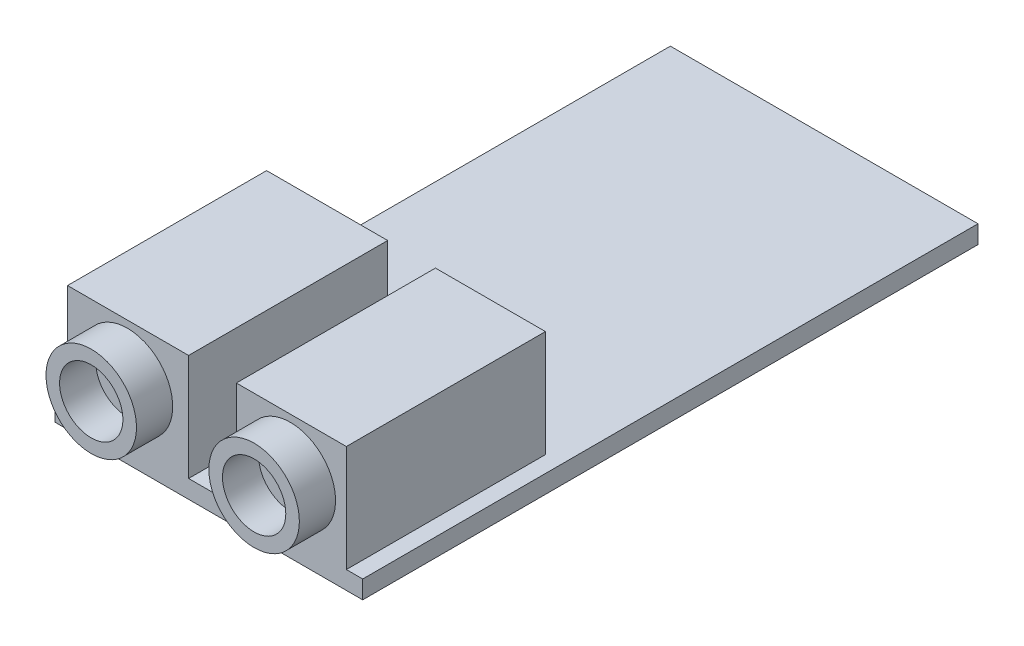
ISO-10303-21;
HEADER;
FILE_DESCRIPTION(('STEP AP214'),'2;1');
FILE_NAME('part.step','',(''),(''),'','','');
FILE_SCHEMA(('AUTOMOTIVE_DESIGN { 1 0 10303 214 1 1 1 1 }'));
ENDSEC;
DATA;
#1=APPLICATION_CONTEXT('core data for automotive mechanical design processes');
#2=APPLICATION_PROTOCOL_DEFINITION('international standard','automotive_design',2000,#1);
#3=PRODUCT_CONTEXT('',#1,'mechanical');
#4=PRODUCT('Part','Part','',(#3));
#5=PRODUCT_RELATED_PRODUCT_CATEGORY('part','',(#4));
#6=PRODUCT_DEFINITION_FORMATION('','',#4);
#7=PRODUCT_DEFINITION_CONTEXT('part definition',#1,'design');
#8=PRODUCT_DEFINITION('design','',#6,#7);
#9=PRODUCT_DEFINITION_SHAPE('','',#8);
#10=(LENGTH_UNIT() NAMED_UNIT(*) SI_UNIT(.MILLI.,.METRE.));
#11=(NAMED_UNIT(*) PLANE_ANGLE_UNIT() SI_UNIT($,.RADIAN.));
#12=(NAMED_UNIT(*) SI_UNIT($,.STERADIAN.) SOLID_ANGLE_UNIT());
#13=UNCERTAINTY_MEASURE_WITH_UNIT(LENGTH_MEASURE(1.E-05),#10,'distance_accuracy_value','');
#14=(GEOMETRIC_REPRESENTATION_CONTEXT(3) GLOBAL_UNCERTAINTY_ASSIGNED_CONTEXT((#13)) GLOBAL_UNIT_ASSIGNED_CONTEXT((#10,
#11,#12)) REPRESENTATION_CONTEXT('',''));
#15=CARTESIAN_POINT('',(0.,0.,0.));
#16=DIRECTION('',(0.,0.,1.));
#17=DIRECTION('',(1.,0.,0.));
#18=AXIS2_PLACEMENT_3D('',#15,#16,#17);
#19=CARTESIAN_POINT('',(0.,1.,0.));
#20=DIRECTION('',(0.,-1.,0.));
#21=DIRECTION('',(0.,0.,-1.));
#22=AXIS2_PLACEMENT_3D('',#19,#20,#21);
#23=PLANE('',#22);
#24=DIRECTION('',(1.,0.,0.));
#25=VECTOR('',#24,1.);
#26=CARTESIAN_POINT('',(-8.5,1.,17.));
#27=LINE('',#26,#25);
#28=CARTESIAN_POINT('',(-1.11955702747559,1.,17.));
#29=VERTEX_POINT('',#28);
#30=CARTESIAN_POINT('',(1.51939882300259,1.,17.));
#31=VERTEX_POINT('',#30);
#32=EDGE_CURVE('E213',#29,#31,#27,.T.);
#33=ORIENTED_EDGE('',*,*,#32,.T.);
#34=DIRECTION('',(0.,0.,1.));
#35=VECTOR('',#34,1.);
#36=CARTESIAN_POINT('',(1.51939882300259,1.,6.00000000000001));
#37=LINE('',#36,#35);
#38=CARTESIAN_POINT('',(1.51939882300259,1.,6.00000000000001));
#39=VERTEX_POINT('',#38);
#40=EDGE_CURVE('E57',#39,#31,#37,.T.);
#41=ORIENTED_EDGE('',*,*,#40,.F.);
#42=DIRECTION('',(1.,0.,0.));
#43=VECTOR('',#42,1.);
#44=CARTESIAN_POINT('',(1.51939882300259,1.,6.00000000000001));
#45=LINE('',#44,#43);
#46=CARTESIAN_POINT('',(7.59699411501296,1.,6.00000000000001));
#47=VERTEX_POINT('',#46);
#48=EDGE_CURVE('E52',#39,#47,#45,.T.);
#49=ORIENTED_EDGE('',*,*,#48,.T.);
#50=DIRECTION('',(0.,0.,1.));
#51=VECTOR('',#50,1.);
#52=CARTESIAN_POINT('',(7.59699411501296,1.,6.00000000000001));
#53=LINE('',#52,#51);
#54=CARTESIAN_POINT('',(7.59699411501296,1.,17.));
#55=VERTEX_POINT('',#54);
#56=EDGE_CURVE('E136',#47,#55,#53,.T.);
#57=ORIENTED_EDGE('',*,*,#56,.T.);
#58=CARTESIAN_POINT('',(8.5,1.,17.));
#59=VERTEX_POINT('',#58);
#60=EDGE_CURVE('E212',#55,#59,#27,.T.);
#61=ORIENTED_EDGE('',*,*,#60,.T.);
#62=DIRECTION('',(0.,0.,-1.));
#63=VECTOR('',#62,1.);
#64=CARTESIAN_POINT('',(8.5,1.,17.));
#65=LINE('',#64,#63);
#66=CARTESIAN_POINT('',(8.5,1.,-17.));
#67=VERTEX_POINT('',#66);
#68=EDGE_CURVE('E216',#59,#67,#65,.T.);
#69=ORIENTED_EDGE('',*,*,#68,.T.);
#70=DIRECTION('',(-1.,0.,0.));
#71=VECTOR('',#70,1.);
#72=CARTESIAN_POINT('',(-8.5,1.,-17.));
#73=LINE('',#72,#71);
#74=CARTESIAN_POINT('',(-8.5,1.,-17.));
#75=VERTEX_POINT('',#74);
#76=EDGE_CURVE('E236',#67,#75,#73,.T.);
#77=ORIENTED_EDGE('',*,*,#76,.T.);
#78=DIRECTION('',(0.,0.,1.));
#79=VECTOR('',#78,1.);
#80=CARTESIAN_POINT('',(-8.5,1.,17.));
#81=LINE('',#80,#79);
#82=CARTESIAN_POINT('',(-8.5,1.,17.));
#83=VERTEX_POINT('',#82);
#84=EDGE_CURVE('E195',#75,#83,#81,.T.);
#85=ORIENTED_EDGE('',*,*,#84,.T.);
#86=CARTESIAN_POINT('',(-7.81024307262736,1.,17.));
#87=VERTEX_POINT('',#86);
#88=EDGE_CURVE('E222',#83,#87,#27,.T.);
#89=ORIENTED_EDGE('',*,*,#88,.T.);
#90=DIRECTION('',(0.,0.,1.));
#91=VECTOR('',#90,1.);
#92=CARTESIAN_POINT('',(-7.81024307262736,1.,6.00000000000001));
#93=LINE('',#92,#91);
#94=CARTESIAN_POINT('',(-7.81024307262736,1.,6.00000000000001));
#95=VERTEX_POINT('',#94);
#96=EDGE_CURVE('E183',#95,#87,#93,.T.);
#97=ORIENTED_EDGE('',*,*,#96,.F.);
#98=DIRECTION('',(1.,0.,0.));
#99=VECTOR('',#98,1.);
#100=CARTESIAN_POINT('',(-7.81024307262736,1.,6.00000000000001));
#101=LINE('',#100,#99);
#102=CARTESIAN_POINT('',(-1.11955702747559,1.,6.00000000000001));
#103=VERTEX_POINT('',#102);
#104=EDGE_CURVE('E173',#95,#103,#101,.T.);
#105=ORIENTED_EDGE('',*,*,#104,.T.);
#106=DIRECTION('',(0.,0.,1.));
#107=VECTOR('',#106,1.);
#108=CARTESIAN_POINT('',(-1.11955702747559,1.,6.00000000000001));
#109=LINE('',#108,#107);
#110=EDGE_CURVE('E192',#103,#29,#109,.T.);
#111=ORIENTED_EDGE('',*,*,#110,.T.);
#112=EDGE_LOOP('',(#33,#41,#49,#57,#61,#69,#77,#85,#89,#97,#105,#111));
#113=FACE_BOUND('',#112,.T.);
#114=ADVANCED_FACE('F37',(#113),#23,.F.);
#115=CARTESIAN_POINT('',(-8.5,1.,17.));
#116=DIRECTION('',(1.,0.,0.));
#117=DIRECTION('',(0.,0.,-1.));
#118=AXIS2_PLACEMENT_3D('',#115,#116,#117);
#119=PLANE('',#118);
#120=DIRECTION('',(0.,0.,1.));
#121=VECTOR('',#120,1.);
#122=CARTESIAN_POINT('',(-8.5,0.,17.));
#123=LINE('',#122,#121);
#124=CARTESIAN_POINT('',(-8.5,0.,-17.));
#125=VERTEX_POINT('',#124);
#126=CARTESIAN_POINT('',(-8.5,0.,17.));
#127=VERTEX_POINT('',#126);
#128=EDGE_CURVE('E189',#125,#127,#123,.T.);
#129=ORIENTED_EDGE('',*,*,#128,.T.);
#130=DIRECTION('',(0.,-1.,0.));
#131=VECTOR('',#130,1.);
#132=CARTESIAN_POINT('',(-8.5,1.,17.));
#133=LINE('',#132,#131);
#134=EDGE_CURVE('E211',#83,#127,#133,.T.);
#135=ORIENTED_EDGE('',*,*,#134,.F.);
#136=ORIENTED_EDGE('',*,*,#84,.F.);
#137=DIRECTION('',(0.,-1.,0.));
#138=VECTOR('',#137,1.);
#139=CARTESIAN_POINT('',(-8.5,1.,-17.));
#140=LINE('',#139,#138);
#141=EDGE_CURVE('E233',#75,#125,#140,.T.);
#142=ORIENTED_EDGE('',*,*,#141,.T.);
#143=EDGE_LOOP('',(#129,#135,#136,#142));
#144=FACE_BOUND('',#143,.T.);
#145=ADVANCED_FACE('F39',(#144),#119,.F.);
#146=CARTESIAN_POINT('',(-8.5,1.,17.));
#147=DIRECTION('',(0.,0.,-1.));
#148=DIRECTION('',(-1.,0.,0.));
#149=AXIS2_PLACEMENT_3D('',#146,#147,#148);
#150=PLANE('',#149);
#151=CARTESIAN_POINT('',(4.5,4.,17.));
#152=DIRECTION('',(0.,0.,-1.));
#153=DIRECTION('',(-1.,0.,0.));
#154=AXIS2_PLACEMENT_3D('',#151,#152,#153);
#155=CIRCLE('',#154,2.5);
#156=CARTESIAN_POINT('',(2.,4.,17.));
#157=VERTEX_POINT('',#156);
#158=EDGE_CURVE('E11',#157,#157,#155,.F.);
#159=ORIENTED_EDGE('',*,*,#158,.F.);
#160=EDGE_LOOP('',(#159));
#161=FACE_BOUND('',#160,.T.);
#162=CARTESIAN_POINT('',(-4.5,4.,17.));
#163=DIRECTION('',(0.,0.,-1.));
#164=DIRECTION('',(-1.,0.,0.));
#165=AXIS2_PLACEMENT_3D('',#162,#163,#164);
#166=CIRCLE('',#165,2.5);
#167=CARTESIAN_POINT('',(-7.,4.,17.));
#168=VERTEX_POINT('',#167);
#169=EDGE_CURVE('E45',#168,#168,#166,.F.);
#170=ORIENTED_EDGE('',*,*,#169,.F.);
#171=EDGE_LOOP('',(#170));
#172=FACE_BOUND('',#171,.T.);
#173=DIRECTION('',(1.,0.,0.));
#174=VECTOR('',#173,1.);
#175=CARTESIAN_POINT('',(-8.5,0.,17.));
#176=LINE('',#175,#174);
#177=CARTESIAN_POINT('',(8.5,0.,17.));
#178=VERTEX_POINT('',#177);
#179=EDGE_CURVE('E241',#127,#178,#176,.T.);
#180=ORIENTED_EDGE('',*,*,#179,.T.);
#181=DIRECTION('',(0.,-1.,0.));
#182=VECTOR('',#181,1.);
#183=CARTESIAN_POINT('',(8.5,1.,17.));
#184=LINE('',#183,#182);
#185=EDGE_CURVE('E227',#59,#178,#184,.T.);
#186=ORIENTED_EDGE('',*,*,#185,.F.);
#187=ORIENTED_EDGE('',*,*,#60,.F.);
#188=DIRECTION('',(0.,1.,0.));
#189=VECTOR('',#188,1.);
#190=CARTESIAN_POINT('',(7.59699411501296,1.,17.));
#191=LINE('',#190,#189);
#192=CARTESIAN_POINT('',(7.59699411501296,6.88856033929579,17.));
#193=VERTEX_POINT('',#192);
#194=EDGE_CURVE('E154',#55,#193,#191,.T.);
#195=ORIENTED_EDGE('',*,*,#194,.T.);
#196=DIRECTION('',(-1.,0.,0.));
#197=VECTOR('',#196,1.);
#198=CARTESIAN_POINT('',(1.51939882300259,6.88856033929579,17.));
#199=LINE('',#198,#197);
#200=CARTESIAN_POINT('',(1.51939882300259,6.88856033929579,17.));
#201=VERTEX_POINT('',#200);
#202=EDGE_CURVE('E131',#193,#201,#199,.T.);
#203=ORIENTED_EDGE('',*,*,#202,.T.);
#204=DIRECTION('',(0.,-1.,0.));
#205=VECTOR('',#204,1.);
#206=CARTESIAN_POINT('',(1.51939882300259,1.,17.));
#207=LINE('',#206,#205);
#208=EDGE_CURVE('E151',#201,#31,#207,.T.);
#209=ORIENTED_EDGE('',*,*,#208,.T.);
#210=ORIENTED_EDGE('',*,*,#32,.F.);
#211=DIRECTION('',(0.,1.,0.));
#212=VECTOR('',#211,1.);
#213=CARTESIAN_POINT('',(-1.11955702747559,1.,17.));
#214=LINE('',#213,#212);
#215=CARTESIAN_POINT('',(-1.11955702747559,6.88856033929579,17.));
#216=VERTEX_POINT('',#215);
#217=EDGE_CURVE('E186',#29,#216,#214,.T.);
#218=ORIENTED_EDGE('',*,*,#217,.T.);
#219=DIRECTION('',(-1.,0.,0.));
#220=VECTOR('',#219,1.);
#221=CARTESIAN_POINT('',(-7.81024307262736,6.88856033929579,17.));
#222=LINE('',#221,#220);
#223=CARTESIAN_POINT('',(-7.81024307262736,6.88856033929579,17.));
#224=VERTEX_POINT('',#223);
#225=EDGE_CURVE('E174',#216,#224,#222,.T.);
#226=ORIENTED_EDGE('',*,*,#225,.T.);
#227=DIRECTION('',(0.,-1.,0.));
#228=VECTOR('',#227,1.);
#229=CARTESIAN_POINT('',(-7.81024307262736,1.,17.));
#230=LINE('',#229,#228);
#231=EDGE_CURVE('E169',#224,#87,#230,.T.);
#232=ORIENTED_EDGE('',*,*,#231,.T.);
#233=ORIENTED_EDGE('',*,*,#88,.F.);
#234=ORIENTED_EDGE('',*,*,#134,.T.);
#235=EDGE_LOOP('',(#180,#186,#187,#195,#203,#209,#210,#218,#226,#232,#233,#234));
#236=FACE_BOUND('',#235,.T.);
#237=ADVANCED_FACE('F262',(#161,#172,#236),#150,.F.);
#238=CARTESIAN_POINT('',(8.5,1.,17.));
#239=DIRECTION('',(-1.,0.,0.));
#240=DIRECTION('',(0.,0.,1.));
#241=AXIS2_PLACEMENT_3D('',#238,#239,#240);
#242=PLANE('',#241);
#243=DIRECTION('',(0.,0.,-1.));
#244=VECTOR('',#243,1.);
#245=CARTESIAN_POINT('',(8.5,0.,17.));
#246=LINE('',#245,#244);
#247=CARTESIAN_POINT('',(8.5,0.,-17.));
#248=VERTEX_POINT('',#247);
#249=EDGE_CURVE('E239',#178,#248,#246,.T.);
#250=ORIENTED_EDGE('',*,*,#249,.T.);
#251=DIRECTION('',(0.,-1.,0.));
#252=VECTOR('',#251,1.);
#253=CARTESIAN_POINT('',(8.5,1.,-17.));
#254=LINE('',#253,#252);
#255=EDGE_CURVE('E230',#67,#248,#254,.T.);
#256=ORIENTED_EDGE('',*,*,#255,.F.);
#257=ORIENTED_EDGE('',*,*,#68,.F.);
#258=ORIENTED_EDGE('',*,*,#185,.T.);
#259=EDGE_LOOP('',(#250,#256,#257,#258));
#260=FACE_BOUND('',#259,.T.);
#261=ADVANCED_FACE('F251',(#260),#242,.F.);
#262=CARTESIAN_POINT('',(-8.5,1.,-17.));
#263=DIRECTION('',(0.,0.,1.));
#264=DIRECTION('',(1.,0.,0.));
#265=AXIS2_PLACEMENT_3D('',#262,#263,#264);
#266=PLANE('',#265);
#267=DIRECTION('',(-1.,0.,0.));
#268=VECTOR('',#267,1.);
#269=CARTESIAN_POINT('',(-8.5,0.,-17.));
#270=LINE('',#269,#268);
#271=EDGE_CURVE('E237',#248,#125,#270,.T.);
#272=ORIENTED_EDGE('',*,*,#271,.T.);
#273=ORIENTED_EDGE('',*,*,#141,.F.);
#274=ORIENTED_EDGE('',*,*,#76,.F.);
#275=ORIENTED_EDGE('',*,*,#255,.T.);
#276=EDGE_LOOP('',(#272,#273,#274,#275));
#277=FACE_BOUND('',#276,.T.);
#278=ADVANCED_FACE('F255',(#277),#266,.F.);
#279=CARTESIAN_POINT('',(0.,0.,0.));
#280=DIRECTION('',(0.,-1.,0.));
#281=DIRECTION('',(0.,0.,-1.));
#282=AXIS2_PLACEMENT_3D('',#279,#280,#281);
#283=PLANE('',#282);
#284=ORIENTED_EDGE('',*,*,#128,.F.);
#285=ORIENTED_EDGE('',*,*,#271,.F.);
#286=ORIENTED_EDGE('',*,*,#249,.F.);
#287=ORIENTED_EDGE('',*,*,#179,.F.);
#288=EDGE_LOOP('',(#284,#285,#286,#287));
#289=FACE_BOUND('',#288,.T.);
#290=ADVANCED_FACE('F316',(#289),#283,.T.);
#291=CARTESIAN_POINT('',(-7.81024307262736,1.,6.00000000000001));
#292=DIRECTION('',(-1.,0.,0.));
#293=DIRECTION('',(0.,0.,1.));
#294=AXIS2_PLACEMENT_3D('',#291,#292,#293);
#295=PLANE('',#294);
#296=ORIENTED_EDGE('',*,*,#231,.F.);
#297=DIRECTION('',(0.,0.,1.));
#298=VECTOR('',#297,1.);
#299=CARTESIAN_POINT('',(-7.81024307262736,6.88856033929579,6.00000000000001));
#300=LINE('',#299,#298);
#301=CARTESIAN_POINT('',(-7.81024307262736,6.88856033929579,6.00000000000001));
#302=VERTEX_POINT('',#301);
#303=EDGE_CURVE('E187',#302,#224,#300,.T.);
#304=ORIENTED_EDGE('',*,*,#303,.F.);
#305=DIRECTION('',(0.,-1.,0.));
#306=VECTOR('',#305,1.);
#307=CARTESIAN_POINT('',(-7.81024307262736,1.,6.00000000000001));
#308=LINE('',#307,#306);
#309=EDGE_CURVE('E170',#302,#95,#308,.T.);
#310=ORIENTED_EDGE('',*,*,#309,.T.);
#311=ORIENTED_EDGE('',*,*,#96,.T.);
#312=EDGE_LOOP('',(#296,#304,#310,#311));
#313=FACE_BOUND('',#312,.T.);
#314=ADVANCED_FACE('F267',(#313),#295,.T.);
#315=CARTESIAN_POINT('',(-7.81024307262736,6.88856033929579,6.00000000000001));
#316=DIRECTION('',(0.,1.,0.));
#317=DIRECTION('',(0.,0.,1.));
#318=AXIS2_PLACEMENT_3D('',#315,#316,#317);
#319=PLANE('',#318);
#320=ORIENTED_EDGE('',*,*,#225,.F.);
#321=DIRECTION('',(0.,0.,1.));
#322=VECTOR('',#321,1.);
#323=CARTESIAN_POINT('',(-1.11955702747559,6.88856033929579,6.00000000000001));
#324=LINE('',#323,#322);
#325=CARTESIAN_POINT('',(-1.11955702747559,6.88856033929579,6.00000000000001));
#326=VERTEX_POINT('',#325);
#327=EDGE_CURVE('E190',#326,#216,#324,.T.);
#328=ORIENTED_EDGE('',*,*,#327,.F.);
#329=DIRECTION('',(-1.,0.,0.));
#330=VECTOR('',#329,1.);
#331=CARTESIAN_POINT('',(-7.81024307262736,6.88856033929579,6.00000000000001));
#332=LINE('',#331,#330);
#333=EDGE_CURVE('E180',#326,#302,#332,.T.);
#334=ORIENTED_EDGE('',*,*,#333,.T.);
#335=ORIENTED_EDGE('',*,*,#303,.T.);
#336=EDGE_LOOP('',(#320,#328,#334,#335));
#337=FACE_BOUND('',#336,.T.);
#338=ADVANCED_FACE('F274',(#337),#319,.T.);
#339=CARTESIAN_POINT('',(-1.11955702747559,1.,6.00000000000001));
#340=DIRECTION('',(1.,0.,0.));
#341=DIRECTION('',(0.,0.,-1.));
#342=AXIS2_PLACEMENT_3D('',#339,#340,#341);
#343=PLANE('',#342);
#344=ORIENTED_EDGE('',*,*,#217,.F.);
#345=ORIENTED_EDGE('',*,*,#110,.F.);
#346=DIRECTION('',(0.,1.,0.));
#347=VECTOR('',#346,1.);
#348=CARTESIAN_POINT('',(-1.11955702747559,1.,6.00000000000001));
#349=LINE('',#348,#347);
#350=EDGE_CURVE('E177',#103,#326,#349,.T.);
#351=ORIENTED_EDGE('',*,*,#350,.T.);
#352=ORIENTED_EDGE('',*,*,#327,.T.);
#353=EDGE_LOOP('',(#344,#345,#351,#352));
#354=FACE_BOUND('',#353,.T.);
#355=ADVANCED_FACE('F276',(#354),#343,.T.);
#356=CARTESIAN_POINT('',(0.,0.,6.00000000000001));
#357=DIRECTION('',(0.,0.,-1.));
#358=DIRECTION('',(-1.,0.,0.));
#359=AXIS2_PLACEMENT_3D('',#356,#357,#358);
#360=PLANE('',#359);
#361=ORIENTED_EDGE('',*,*,#309,.F.);
#362=ORIENTED_EDGE('',*,*,#333,.F.);
#363=ORIENTED_EDGE('',*,*,#350,.F.);
#364=ORIENTED_EDGE('',*,*,#104,.F.);
#365=EDGE_LOOP('',(#361,#362,#363,#364));
#366=FACE_BOUND('',#365,.T.);
#367=ADVANCED_FACE('F271',(#366),#360,.T.);
#368=CARTESIAN_POINT('',(-4.5,4.,19.));
#369=DIRECTION('',(0.,0.,1.));
#370=DIRECTION('',(1.,0.,0.));
#371=AXIS2_PLACEMENT_3D('',#368,#369,#370);
#372=PLANE('',#371);
#373=CARTESIAN_POINT('',(-4.5,4.,19.));
#374=DIRECTION('',(0.,0.,1.));
#375=DIRECTION('',(1.,0.,0.));
#376=AXIS2_PLACEMENT_3D('',#373,#374,#375);
#377=CIRCLE('',#376,2.5);
#378=CARTESIAN_POINT('',(-2.,4.,19.));
#379=VERTEX_POINT('',#378);
#380=EDGE_CURVE('E164',#379,#379,#377,.T.);
#381=ORIENTED_EDGE('',*,*,#380,.T.);
#382=EDGE_LOOP('',(#381));
#383=FACE_BOUND('',#382,.T.);
#384=CARTESIAN_POINT('',(-4.5,4.,19.));
#385=DIRECTION('',(0.,0.,1.));
#386=DIRECTION('',(1.,0.,0.));
#387=AXIS2_PLACEMENT_3D('',#384,#385,#386);
#388=CIRCLE('',#387,1.75);
#389=CARTESIAN_POINT('',(-2.75,4.,19.));
#390=VERTEX_POINT('',#389);
#391=EDGE_CURVE('E161',#390,#390,#388,.T.);
#392=ORIENTED_EDGE('',*,*,#391,.F.);
#393=EDGE_LOOP('',(#392));
#394=FACE_BOUND('',#393,.T.);
#395=ADVANCED_FACE('F349',(#383,#394),#372,.T.);
#396=CARTESIAN_POINT('',(-4.5,4.,19.));
#397=DIRECTION('',(0.,0.,-1.));
#398=DIRECTION('',(-1.,0.,0.));
#399=AXIS2_PLACEMENT_3D('',#396,#397,#398);
#400=CYLINDRICAL_SURFACE('',#399,2.5);
#401=ORIENTED_EDGE('',*,*,#380,.F.);
#402=EDGE_LOOP('',(#401));
#403=FACE_BOUND('',#402,.T.);
#404=ORIENTED_EDGE('',*,*,#169,.T.);
#405=EDGE_LOOP('',(#404));
#406=FACE_BOUND('',#405,.T.);
#407=ADVANCED_FACE('F341',(#403,#406),#400,.T.);
#408=CARTESIAN_POINT('',(-4.5,4.,19.));
#409=DIRECTION('',(0.,0.,-1.));
#410=DIRECTION('',(-1.,0.,0.));
#411=AXIS2_PLACEMENT_3D('',#408,#409,#410);
#412=CYLINDRICAL_SURFACE('',#411,1.75);
#413=ORIENTED_EDGE('',*,*,#391,.T.);
#414=EDGE_LOOP('',(#413));
#415=FACE_BOUND('',#414,.T.);
#416=CARTESIAN_POINT('',(-4.5,4.,17.));
#417=DIRECTION('',(0.,0.,1.));
#418=DIRECTION('',(1.,0.,0.));
#419=AXIS2_PLACEMENT_3D('',#416,#417,#418);
#420=CIRCLE('',#419,1.75);
#421=CARTESIAN_POINT('',(-2.75,4.,17.));
#422=VERTEX_POINT('',#421);
#423=EDGE_CURVE('E158',#422,#422,#420,.T.);
#424=ORIENTED_EDGE('',*,*,#423,.F.);
#425=EDGE_LOOP('',(#424));
#426=FACE_BOUND('',#425,.T.);
#427=ADVANCED_FACE('F334',(#415,#426),#412,.F.);
#428=ORIENTED_EDGE('',*,*,#423,.T.);
#429=EDGE_LOOP('',(#428));
#430=FACE_BOUND('',#429,.T.);
#431=ADVANCED_FACE('F326',(#430),#150,.F.);
#432=CARTESIAN_POINT('',(1.51939882300259,1.,6.00000000000001));
#433=DIRECTION('',(-1.,0.,0.));
#434=DIRECTION('',(0.,0.,1.));
#435=AXIS2_PLACEMENT_3D('',#432,#433,#434);
#436=PLANE('',#435);
#437=ORIENTED_EDGE('',*,*,#208,.F.);
#438=DIRECTION('',(0.,0.,1.));
#439=VECTOR('',#438,1.);
#440=CARTESIAN_POINT('',(1.51939882300259,6.88856033929579,6.00000000000001));
#441=LINE('',#440,#439);
#442=CARTESIAN_POINT('',(1.51939882300259,6.88856033929579,6.00000000000001));
#443=VERTEX_POINT('',#442);
#444=EDGE_CURVE('E135',#443,#201,#441,.T.);
#445=ORIENTED_EDGE('',*,*,#444,.F.);
#446=DIRECTION('',(0.,-1.,0.));
#447=VECTOR('',#446,1.);
#448=CARTESIAN_POINT('',(1.51939882300259,1.,6.00000000000001));
#449=LINE('',#448,#447);
#450=EDGE_CURVE('E146',#443,#39,#449,.T.);
#451=ORIENTED_EDGE('',*,*,#450,.T.);
#452=ORIENTED_EDGE('',*,*,#40,.T.);
#453=EDGE_LOOP('',(#437,#445,#451,#452));
#454=FACE_BOUND('',#453,.T.);
#455=ADVANCED_FACE('F280',(#454),#436,.T.);
#456=CARTESIAN_POINT('',(1.51939882300259,6.88856033929579,6.00000000000001));
#457=DIRECTION('',(0.,1.,0.));
#458=DIRECTION('',(0.,0.,1.));
#459=AXIS2_PLACEMENT_3D('',#456,#457,#458);
#460=PLANE('',#459);
#461=ORIENTED_EDGE('',*,*,#202,.F.);
#462=DIRECTION('',(0.,0.,1.));
#463=VECTOR('',#462,1.);
#464=CARTESIAN_POINT('',(7.59699411501296,6.88856033929579,6.00000000000001));
#465=LINE('',#464,#463);
#466=CARTESIAN_POINT('',(7.59699411501296,6.88856033929579,6.00000000000001));
#467=VERTEX_POINT('',#466);
#468=EDGE_CURVE('E125',#467,#193,#465,.T.);
#469=ORIENTED_EDGE('',*,*,#468,.F.);
#470=DIRECTION('',(-1.,0.,0.));
#471=VECTOR('',#470,1.);
#472=CARTESIAN_POINT('',(1.51939882300259,6.88856033929579,6.00000000000001));
#473=LINE('',#472,#471);
#474=EDGE_CURVE('E129',#467,#443,#473,.T.);
#475=ORIENTED_EDGE('',*,*,#474,.T.);
#476=ORIENTED_EDGE('',*,*,#444,.T.);
#477=EDGE_LOOP('',(#461,#469,#475,#476));
#478=FACE_BOUND('',#477,.T.);
#479=ADVANCED_FACE('F127',(#478),#460,.T.);
#480=CARTESIAN_POINT('',(7.59699411501296,1.,6.00000000000001));
#481=DIRECTION('',(1.,0.,0.));
#482=DIRECTION('',(0.,0.,-1.));
#483=AXIS2_PLACEMENT_3D('',#480,#481,#482);
#484=PLANE('',#483);
#485=ORIENTED_EDGE('',*,*,#194,.F.);
#486=ORIENTED_EDGE('',*,*,#56,.F.);
#487=DIRECTION('',(0.,1.,0.));
#488=VECTOR('',#487,1.);
#489=CARTESIAN_POINT('',(7.59699411501296,1.,6.00000000000001));
#490=LINE('',#489,#488);
#491=EDGE_CURVE('E139',#47,#467,#490,.T.);
#492=ORIENTED_EDGE('',*,*,#491,.T.);
#493=ORIENTED_EDGE('',*,*,#468,.T.);
#494=EDGE_LOOP('',(#485,#486,#492,#493));
#495=FACE_BOUND('',#494,.T.);
#496=ADVANCED_FACE('F140',(#495),#484,.T.);
#497=CARTESIAN_POINT('',(0.,0.,6.00000000000001));
#498=DIRECTION('',(0.,0.,-1.));
#499=DIRECTION('',(-1.,0.,0.));
#500=AXIS2_PLACEMENT_3D('',#497,#498,#499);
#501=PLANE('',#500);
#502=ORIENTED_EDGE('',*,*,#450,.F.);
#503=ORIENTED_EDGE('',*,*,#474,.F.);
#504=ORIENTED_EDGE('',*,*,#491,.F.);
#505=ORIENTED_EDGE('',*,*,#48,.F.);
#506=EDGE_LOOP('',(#502,#503,#504,#505));
#507=FACE_BOUND('',#506,.T.);
#508=ADVANCED_FACE('F144',(#507),#501,.T.);
#509=CARTESIAN_POINT('',(4.5,4.,19.));
#510=DIRECTION('',(0.,0.,1.));
#511=DIRECTION('',(1.,0.,0.));
#512=AXIS2_PLACEMENT_3D('',#509,#510,#511);
#513=PLANE('',#512);
#514=CARTESIAN_POINT('',(4.5,4.,19.));
#515=DIRECTION('',(0.,0.,1.));
#516=DIRECTION('',(1.,0.,0.));
#517=AXIS2_PLACEMENT_3D('',#514,#515,#516);
#518=CIRCLE('',#517,2.5);
#519=CARTESIAN_POINT('',(7.,4.,19.));
#520=VERTEX_POINT('',#519);
#521=EDGE_CURVE('E155',#520,#520,#518,.T.);
#522=ORIENTED_EDGE('',*,*,#521,.T.);
#523=EDGE_LOOP('',(#522));
#524=FACE_BOUND('',#523,.T.);
#525=CARTESIAN_POINT('',(4.5,4.,19.));
#526=DIRECTION('',(0.,0.,1.));
#527=DIRECTION('',(1.,0.,0.));
#528=AXIS2_PLACEMENT_3D('',#525,#526,#527);
#529=CIRCLE('',#528,1.75);
#530=CARTESIAN_POINT('',(6.25,4.,19.));
#531=VERTEX_POINT('',#530);
#532=EDGE_CURVE('E285',#531,#531,#529,.T.);
#533=ORIENTED_EDGE('',*,*,#532,.F.);
#534=EDGE_LOOP('',(#533));
#535=FACE_BOUND('',#534,.T.);
#536=ADVANCED_FACE('F295',(#524,#535),#513,.T.);
#537=CARTESIAN_POINT('',(4.5,4.,19.));
#538=DIRECTION('',(0.,0.,-1.));
#539=DIRECTION('',(-1.,0.,0.));
#540=AXIS2_PLACEMENT_3D('',#537,#538,#539);
#541=CYLINDRICAL_SURFACE('',#540,2.5);
#542=ORIENTED_EDGE('',*,*,#521,.F.);
#543=EDGE_LOOP('',(#542));
#544=FACE_BOUND('',#543,.T.);
#545=ORIENTED_EDGE('',*,*,#158,.T.);
#546=EDGE_LOOP('',(#545));
#547=FACE_BOUND('',#546,.T.);
#548=ADVANCED_FACE('F297',(#544,#547),#541,.T.);
#549=CARTESIAN_POINT('',(4.5,4.,19.));
#550=DIRECTION('',(0.,0.,-1.));
#551=DIRECTION('',(-1.,0.,0.));
#552=AXIS2_PLACEMENT_3D('',#549,#550,#551);
#553=CYLINDRICAL_SURFACE('',#552,1.75);
#554=ORIENTED_EDGE('',*,*,#532,.T.);
#555=EDGE_LOOP('',(#554));
#556=FACE_BOUND('',#555,.T.);
#557=CARTESIAN_POINT('',(4.5,4.,17.));
#558=DIRECTION('',(0.,0.,1.));
#559=DIRECTION('',(1.,0.,0.));
#560=AXIS2_PLACEMENT_3D('',#557,#558,#559);
#561=CIRCLE('',#560,1.75);
#562=CARTESIAN_POINT('',(6.25,4.,17.));
#563=VERTEX_POINT('',#562);
#564=EDGE_CURVE('E286',#563,#563,#561,.T.);
#565=ORIENTED_EDGE('',*,*,#564,.F.);
#566=EDGE_LOOP('',(#565));
#567=FACE_BOUND('',#566,.T.);
#568=ADVANCED_FACE('F292',(#556,#567),#553,.F.);
#569=ORIENTED_EDGE('',*,*,#564,.T.);
#570=EDGE_LOOP('',(#569));
#571=FACE_BOUND('',#570,.T.);
#572=ADVANCED_FACE('F325',(#571),#150,.F.);
#573=CLOSED_SHELL('',(#114,#145,#237,#261,#278,#290,#314,#338,#355,#367,#395,#407,#427,#431,
#455,#479,#496,#508,#536,#548,#568,#572));
#574=MANIFOLD_SOLID_BREP('B2',#573);
#575=ADVANCED_BREP_SHAPE_REPRESENTATION('',(#18,#574),#14);
#576=SHAPE_DEFINITION_REPRESENTATION(#9,#575);
ENDSEC;
END-ISO-10303-21;
